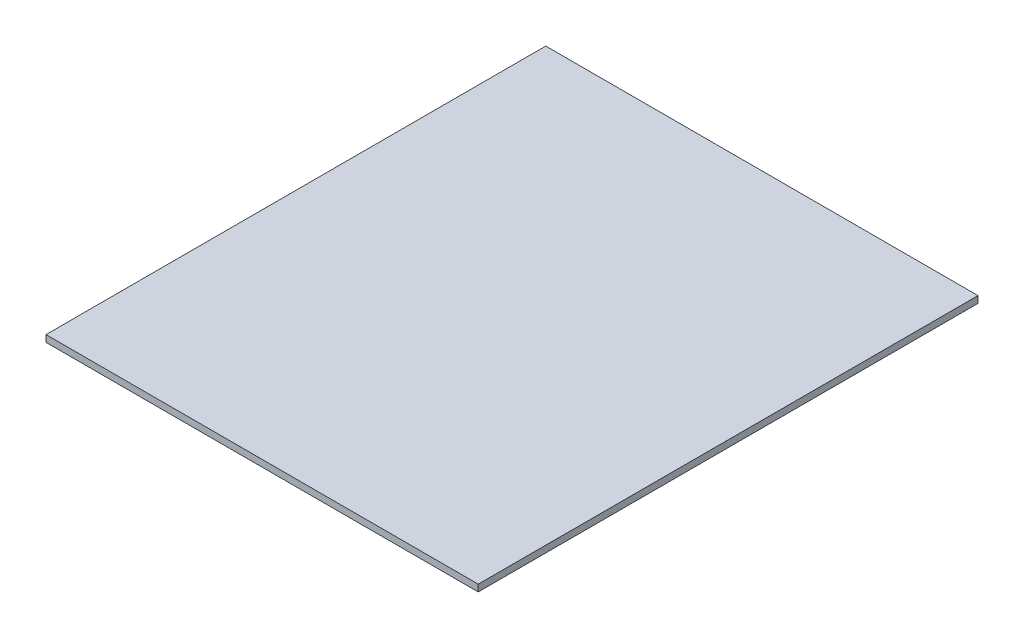
ISO-10303-21;
HEADER;
FILE_DESCRIPTION(('STEP AP214'),'2;1');
FILE_NAME('part.step','',(''),(''),'','','');
FILE_SCHEMA(('AUTOMOTIVE_DESIGN { 1 0 10303 214 1 1 1 1 }'));
ENDSEC;
DATA;
#1=APPLICATION_CONTEXT('core data for automotive mechanical design processes');
#2=APPLICATION_PROTOCOL_DEFINITION('international standard','automotive_design',2000,#1);
#3=PRODUCT_CONTEXT('',#1,'mechanical');
#4=PRODUCT('Part','Part','',(#3));
#5=PRODUCT_RELATED_PRODUCT_CATEGORY('part','',(#4));
#6=PRODUCT_DEFINITION_FORMATION('','',#4);
#7=PRODUCT_DEFINITION_CONTEXT('part definition',#1,'design');
#8=PRODUCT_DEFINITION('design','',#6,#7);
#9=PRODUCT_DEFINITION_SHAPE('','',#8);
#10=(LENGTH_UNIT() NAMED_UNIT(*) SI_UNIT(.MILLI.,.METRE.));
#11=(NAMED_UNIT(*) PLANE_ANGLE_UNIT() SI_UNIT($,.RADIAN.));
#12=(NAMED_UNIT(*) SI_UNIT($,.STERADIAN.) SOLID_ANGLE_UNIT());
#13=UNCERTAINTY_MEASURE_WITH_UNIT(LENGTH_MEASURE(1.E-05),#10,'distance_accuracy_value','');
#14=(GEOMETRIC_REPRESENTATION_CONTEXT(3) GLOBAL_UNCERTAINTY_ASSIGNED_CONTEXT((#13)) GLOBAL_UNIT_ASSIGNED_CONTEXT((#10,
#11,#12)) REPRESENTATION_CONTEXT('',''));
#15=CARTESIAN_POINT('',(0.,0.,0.));
#16=DIRECTION('',(0.,0.,1.));
#17=DIRECTION('',(1.,0.,0.));
#18=AXIS2_PLACEMENT_3D('',#15,#16,#17);
#19=CARTESIAN_POINT('',(-178.056929535572,273.611721565593,-471.994417004189));
#20=DIRECTION('',(0.,-1.,0.));
#21=DIRECTION('',(0.,0.,-1.));
#22=AXIS2_PLACEMENT_3D('',#19,#20,#21);
#23=PLANE('',#22);
#24=DIRECTION('',(-1.,0.,0.));
#25=VECTOR('',#24,1.);
#26=CARTESIAN_POINT('',(-178.056929535572,273.611721565593,236.005582995811));
#27=LINE('',#26,#25);
#28=CARTESIAN_POINT('',(441.943070464428,273.611721565593,236.005582995811));
#29=VERTEX_POINT('',#28);
#30=CARTESIAN_POINT('',(-198.056929535572,273.611721565593,236.005582995811));
#31=VERTEX_POINT('',#30);
#32=EDGE_CURVE('E94',#29,#31,#27,.T.);
#33=ORIENTED_EDGE('',*,*,#32,.F.);
#34=DIRECTION('',(0.,0.,1.));
#35=VECTOR('',#34,1.);
#36=CARTESIAN_POINT('',(441.943070464428,273.611721565593,-471.994417004189));
#37=LINE('',#36,#35);
#38=CARTESIAN_POINT('',(441.943070464428,273.611721565593,-503.994417004189));
#39=VERTEX_POINT('',#38);
#40=EDGE_CURVE('E95',#39,#29,#37,.T.);
#41=ORIENTED_EDGE('',*,*,#40,.F.);
#42=DIRECTION('',(1.,0.,0.));
#43=VECTOR('',#42,1.);
#44=CARTESIAN_POINT('',(-178.056929535572,273.611721565593,-503.994417004189));
#45=LINE('',#44,#43);
#46=CARTESIAN_POINT('',(-198.056929535572,273.611721565593,-503.994417004189));
#47=VERTEX_POINT('',#46);
#48=EDGE_CURVE('E72',#47,#39,#45,.T.);
#49=ORIENTED_EDGE('',*,*,#48,.F.);
#50=DIRECTION('',(0.,0.,-1.));
#51=VECTOR('',#50,1.);
#52=CARTESIAN_POINT('',(-198.056929535572,273.611721565593,-471.994417004189));
#53=LINE('',#52,#51);
#54=EDGE_CURVE('E48',#31,#47,#53,.T.);
#55=ORIENTED_EDGE('',*,*,#54,.F.);
#56=EDGE_LOOP('',(#33,#41,#49,#55));
#57=FACE_BOUND('',#56,.T.);
#58=ADVANCED_FACE('F39',(#57),#23,.F.);
#59=CARTESIAN_POINT('',(-178.056929535572,263.611721565593,-471.994417004189));
#60=DIRECTION('',(0.,-1.,0.));
#61=DIRECTION('',(0.,0.,-1.));
#62=AXIS2_PLACEMENT_3D('',#59,#60,#61);
#63=PLANE('',#62);
#64=DIRECTION('',(-1.,0.,0.));
#65=VECTOR('',#64,1.);
#66=CARTESIAN_POINT('',(-178.056929535572,263.611721565593,236.005582995811));
#67=LINE('',#66,#65);
#68=CARTESIAN_POINT('',(441.943070464428,263.611721565593,236.005582995811));
#69=VERTEX_POINT('',#68);
#70=CARTESIAN_POINT('',(-198.056929535572,263.611721565593,236.005582995811));
#71=VERTEX_POINT('',#70);
#72=EDGE_CURVE('E85',#69,#71,#67,.T.);
#73=ORIENTED_EDGE('',*,*,#72,.T.);
#74=DIRECTION('',(0.,0.,-1.));
#75=VECTOR('',#74,1.);
#76=CARTESIAN_POINT('',(-198.056929535572,263.611721565593,-471.994417004189));
#77=LINE('',#76,#75);
#78=CARTESIAN_POINT('',(-198.056929535572,263.611721565593,-503.994417004189));
#79=VERTEX_POINT('',#78);
#80=EDGE_CURVE('E11',#71,#79,#77,.T.);
#81=ORIENTED_EDGE('',*,*,#80,.T.);
#82=DIRECTION('',(1.,0.,0.));
#83=VECTOR('',#82,1.);
#84=CARTESIAN_POINT('',(-178.056929535572,263.611721565593,-503.994417004189));
#85=LINE('',#84,#83);
#86=CARTESIAN_POINT('',(441.943070464428,263.611721565593,-503.994417004189));
#87=VERTEX_POINT('',#86);
#88=EDGE_CURVE('E57',#79,#87,#85,.T.);
#89=ORIENTED_EDGE('',*,*,#88,.T.);
#90=DIRECTION('',(0.,0.,1.));
#91=VECTOR('',#90,1.);
#92=CARTESIAN_POINT('',(441.943070464428,263.611721565593,-471.994417004189));
#93=LINE('',#92,#91);
#94=EDGE_CURVE('E98',#87,#69,#93,.T.);
#95=ORIENTED_EDGE('',*,*,#94,.T.);
#96=EDGE_LOOP('',(#73,#81,#89,#95));
#97=FACE_BOUND('',#96,.T.);
#98=ADVANCED_FACE('F97',(#97),#63,.T.);
#99=CARTESIAN_POINT('',(-178.056929535572,263.611721565593,236.005582995811));
#100=DIRECTION('',(0.,0.,-1.));
#101=DIRECTION('',(0.,1.,0.));
#102=AXIS2_PLACEMENT_3D('',#99,#100,#101);
#103=PLANE('',#102);
#104=ORIENTED_EDGE('',*,*,#32,.T.);
#105=DIRECTION('',(0.,1.,0.));
#106=VECTOR('',#105,1.);
#107=CARTESIAN_POINT('',(-198.056929535572,263.611721565593,236.005582995811));
#108=LINE('',#107,#106);
#109=EDGE_CURVE('E89',#71,#31,#108,.T.);
#110=ORIENTED_EDGE('',*,*,#109,.F.);
#111=ORIENTED_EDGE('',*,*,#72,.F.);
#112=DIRECTION('',(0.,1.,0.));
#113=VECTOR('',#112,1.);
#114=CARTESIAN_POINT('',(441.943070464428,263.611721565593,236.005582995811));
#115=LINE('',#114,#113);
#116=EDGE_CURVE('E42',#69,#29,#115,.T.);
#117=ORIENTED_EDGE('',*,*,#116,.T.);
#118=EDGE_LOOP('',(#104,#110,#111,#117));
#119=FACE_BOUND('',#118,.T.);
#120=ADVANCED_FACE('F92',(#119),#103,.F.);
#121=CARTESIAN_POINT('',(441.943070464428,263.611721565593,-471.994417004189));
#122=DIRECTION('',(-1.,0.,0.));
#123=DIRECTION('',(0.,0.,1.));
#124=AXIS2_PLACEMENT_3D('',#121,#122,#123);
#125=PLANE('',#124);
#126=ORIENTED_EDGE('',*,*,#40,.T.);
#127=ORIENTED_EDGE('',*,*,#116,.F.);
#128=ORIENTED_EDGE('',*,*,#94,.F.);
#129=DIRECTION('',(0.,1.,0.));
#130=VECTOR('',#129,1.);
#131=CARTESIAN_POINT('',(441.943070464428,263.611721565593,-503.994417004189));
#132=LINE('',#131,#130);
#133=EDGE_CURVE('E102',#87,#39,#132,.T.);
#134=ORIENTED_EDGE('',*,*,#133,.T.);
#135=EDGE_LOOP('',(#126,#127,#128,#134));
#136=FACE_BOUND('',#135,.T.);
#137=ADVANCED_FACE('F111',(#136),#125,.F.);
#138=CARTESIAN_POINT('',(-178.056929535572,263.611721565593,-503.994417004189));
#139=DIRECTION('',(0.,0.,1.));
#140=DIRECTION('',(0.,-1.,0.));
#141=AXIS2_PLACEMENT_3D('',#138,#139,#140);
#142=PLANE('',#141);
#143=ORIENTED_EDGE('',*,*,#48,.T.);
#144=ORIENTED_EDGE('',*,*,#133,.F.);
#145=ORIENTED_EDGE('',*,*,#88,.F.);
#146=DIRECTION('',(0.,1.,0.));
#147=VECTOR('',#146,1.);
#148=CARTESIAN_POINT('',(-198.056929535572,263.611721565593,-503.994417004189));
#149=LINE('',#148,#147);
#150=EDGE_CURVE('E90',#79,#47,#149,.T.);
#151=ORIENTED_EDGE('',*,*,#150,.T.);
#152=EDGE_LOOP('',(#143,#144,#145,#151));
#153=FACE_BOUND('',#152,.T.);
#154=ADVANCED_FACE('F118',(#153),#142,.F.);
#155=CARTESIAN_POINT('',(-198.056929535572,263.611721565593,-471.994417004189));
#156=DIRECTION('',(1.,0.,0.));
#157=DIRECTION('',(0.,0.,-1.));
#158=AXIS2_PLACEMENT_3D('',#155,#156,#157);
#159=PLANE('',#158);
#160=ORIENTED_EDGE('',*,*,#54,.T.);
#161=ORIENTED_EDGE('',*,*,#150,.F.);
#162=ORIENTED_EDGE('',*,*,#80,.F.);
#163=ORIENTED_EDGE('',*,*,#109,.T.);
#164=EDGE_LOOP('',(#160,#161,#162,#163));
#165=FACE_BOUND('',#164,.T.);
#166=ADVANCED_FACE('F88',(#165),#159,.F.);
#167=CLOSED_SHELL('',(#58,#98,#120,#137,#154,#166));
#168=MANIFOLD_SOLID_BREP('B2',#167);
#169=ADVANCED_BREP_SHAPE_REPRESENTATION('',(#18,#168),#14);
#170=SHAPE_DEFINITION_REPRESENTATION(#9,#169);
ENDSEC;
END-ISO-10303-21;
